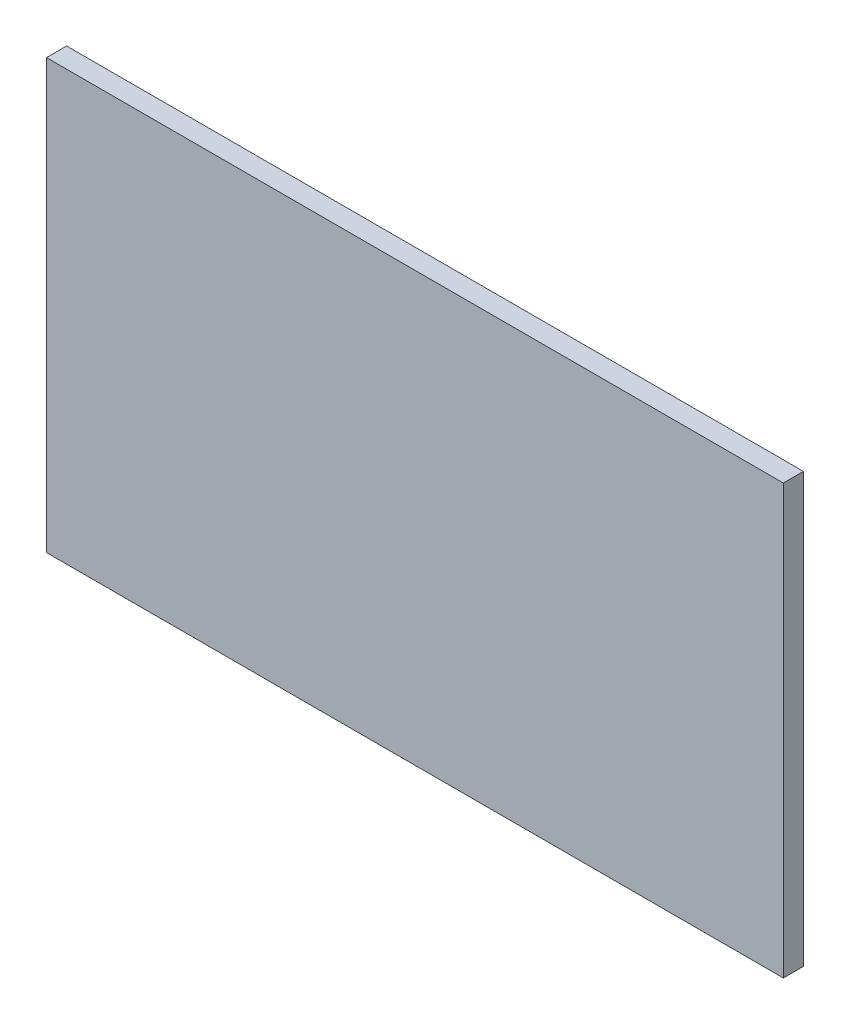
ISO-10303-21;
HEADER;
FILE_DESCRIPTION(('STEP AP214'),'2;1');
FILE_NAME('part.step','',(''),(''),'','','');
FILE_SCHEMA(('AUTOMOTIVE_DESIGN { 1 0 10303 214 1 1 1 1 }'));
ENDSEC;
DATA;
#1=APPLICATION_CONTEXT('core data for automotive mechanical design processes');
#2=APPLICATION_PROTOCOL_DEFINITION('international standard','automotive_design',2000,#1);
#3=PRODUCT_CONTEXT('',#1,'mechanical');
#4=PRODUCT('Part','Part','',(#3));
#5=PRODUCT_RELATED_PRODUCT_CATEGORY('part','',(#4));
#6=PRODUCT_DEFINITION_FORMATION('','',#4);
#7=PRODUCT_DEFINITION_CONTEXT('part definition',#1,'design');
#8=PRODUCT_DEFINITION('design','',#6,#7);
#9=PRODUCT_DEFINITION_SHAPE('','',#8);
#10=(LENGTH_UNIT() NAMED_UNIT(*) SI_UNIT(.MILLI.,.METRE.));
#11=(NAMED_UNIT(*) PLANE_ANGLE_UNIT() SI_UNIT($,.RADIAN.));
#12=(NAMED_UNIT(*) SI_UNIT($,.STERADIAN.) SOLID_ANGLE_UNIT());
#13=UNCERTAINTY_MEASURE_WITH_UNIT(LENGTH_MEASURE(1.E-05),#10,'distance_accuracy_value','');
#14=(GEOMETRIC_REPRESENTATION_CONTEXT(3) GLOBAL_UNCERTAINTY_ASSIGNED_CONTEXT((#13)) GLOBAL_UNIT_ASSIGNED_CONTEXT((#10,
#11,#12)) REPRESENTATION_CONTEXT('',''));
#15=CARTESIAN_POINT('',(0.,0.,0.));
#16=DIRECTION('',(0.,0.,1.));
#17=DIRECTION('',(1.,0.,0.));
#18=AXIS2_PLACEMENT_3D('',#15,#16,#17);
#19=CARTESIAN_POINT('',(0.,-64.,3.));
#20=DIRECTION('',(1.,0.,0.));
#21=DIRECTION('',(0.,0.,-1.));
#22=AXIS2_PLACEMENT_3D('',#19,#20,#21);
#23=PLANE('',#22);
#24=DIRECTION('',(0.,-1.,0.));
#25=VECTOR('',#24,1.);
#26=CARTESIAN_POINT('',(0.,-64.,0.));
#27=LINE('',#26,#25);
#28=CARTESIAN_POINT('',(0.,0.,0.));
#29=VERTEX_POINT('',#28);
#30=CARTESIAN_POINT('',(0.,-64.,0.));
#31=VERTEX_POINT('',#30);
#32=EDGE_CURVE('E107',#29,#31,#27,.T.);
#33=ORIENTED_EDGE('',*,*,#32,.T.);
#34=DIRECTION('',(0.,0.,-1.));
#35=VECTOR('',#34,1.);
#36=CARTESIAN_POINT('',(0.,-64.,3.));
#37=LINE('',#36,#35);
#38=CARTESIAN_POINT('',(0.,-64.,3.));
#39=VERTEX_POINT('',#38);
#40=EDGE_CURVE('E11',#39,#31,#37,.T.);
#41=ORIENTED_EDGE('',*,*,#40,.F.);
#42=DIRECTION('',(0.,-1.,0.));
#43=VECTOR('',#42,1.);
#44=CARTESIAN_POINT('',(0.,-64.,3.));
#45=LINE('',#44,#43);
#46=CARTESIAN_POINT('',(0.,0.,3.));
#47=VERTEX_POINT('',#46);
#48=EDGE_CURVE('E91',#47,#39,#45,.T.);
#49=ORIENTED_EDGE('',*,*,#48,.F.);
#50=DIRECTION('',(0.,0.,-1.));
#51=VECTOR('',#50,1.);
#52=CARTESIAN_POINT('',(0.,0.,3.));
#53=LINE('',#52,#51);
#54=EDGE_CURVE('E103',#47,#29,#53,.T.);
#55=ORIENTED_EDGE('',*,*,#54,.T.);
#56=EDGE_LOOP('',(#33,#41,#49,#55));
#57=FACE_BOUND('',#56,.T.);
#58=ADVANCED_FACE('F39',(#57),#23,.F.);
#59=CARTESIAN_POINT('',(110.,-64.,3.));
#60=DIRECTION('',(0.,1.,0.));
#61=DIRECTION('',(-1.,0.,0.));
#62=AXIS2_PLACEMENT_3D('',#59,#60,#61);
#63=PLANE('',#62);
#64=DIRECTION('',(1.,0.,0.));
#65=VECTOR('',#64,1.);
#66=CARTESIAN_POINT('',(110.,-64.,0.));
#67=LINE('',#66,#65);
#68=CARTESIAN_POINT('',(110.,-64.,0.));
#69=VERTEX_POINT('',#68);
#70=EDGE_CURVE('E96',#31,#69,#67,.T.);
#71=ORIENTED_EDGE('',*,*,#70,.T.);
#72=DIRECTION('',(0.,0.,-1.));
#73=VECTOR('',#72,1.);
#74=CARTESIAN_POINT('',(110.,-64.,3.));
#75=LINE('',#74,#73);
#76=CARTESIAN_POINT('',(110.,-64.,3.));
#77=VERTEX_POINT('',#76);
#78=EDGE_CURVE('E48',#77,#69,#75,.T.);
#79=ORIENTED_EDGE('',*,*,#78,.F.);
#80=DIRECTION('',(1.,0.,0.));
#81=VECTOR('',#80,1.);
#82=CARTESIAN_POINT('',(110.,-64.,3.));
#83=LINE('',#82,#81);
#84=EDGE_CURVE('E86',#39,#77,#83,.T.);
#85=ORIENTED_EDGE('',*,*,#84,.F.);
#86=ORIENTED_EDGE('',*,*,#40,.T.);
#87=EDGE_LOOP('',(#71,#79,#85,#86));
#88=FACE_BOUND('',#87,.T.);
#89=ADVANCED_FACE('F95',(#88),#63,.F.);
#90=CARTESIAN_POINT('',(110.,0.,3.));
#91=DIRECTION('',(-1.,0.,0.));
#92=DIRECTION('',(0.,-1.,0.));
#93=AXIS2_PLACEMENT_3D('',#90,#91,#92);
#94=PLANE('',#93);
#95=DIRECTION('',(0.,1.,0.));
#96=VECTOR('',#95,1.);
#97=CARTESIAN_POINT('',(110.,0.,0.));
#98=LINE('',#97,#96);
#99=CARTESIAN_POINT('',(110.,0.,0.));
#100=VERTEX_POINT('',#99);
#101=EDGE_CURVE('E73',#69,#100,#98,.T.);
#102=ORIENTED_EDGE('',*,*,#101,.T.);
#103=DIRECTION('',(0.,0.,-1.));
#104=VECTOR('',#103,1.);
#105=CARTESIAN_POINT('',(110.,0.,3.));
#106=LINE('',#105,#104);
#107=CARTESIAN_POINT('',(110.,0.,3.));
#108=VERTEX_POINT('',#107);
#109=EDGE_CURVE('E98',#108,#100,#106,.T.);
#110=ORIENTED_EDGE('',*,*,#109,.F.);
#111=DIRECTION('',(0.,1.,0.));
#112=VECTOR('',#111,1.);
#113=CARTESIAN_POINT('',(110.,0.,3.));
#114=LINE('',#113,#112);
#115=EDGE_CURVE('E89',#77,#108,#114,.T.);
#116=ORIENTED_EDGE('',*,*,#115,.F.);
#117=ORIENTED_EDGE('',*,*,#78,.T.);
#118=EDGE_LOOP('',(#102,#110,#116,#117));
#119=FACE_BOUND('',#118,.T.);
#120=ADVANCED_FACE('F99',(#119),#94,.F.);
#121=CARTESIAN_POINT('',(0.,0.,3.));
#122=DIRECTION('',(0.,-1.,0.));
#123=DIRECTION('',(0.,0.,-1.));
#124=AXIS2_PLACEMENT_3D('',#121,#122,#123);
#125=PLANE('',#124);
#126=DIRECTION('',(-1.,0.,0.));
#127=VECTOR('',#126,1.);
#128=CARTESIAN_POINT('',(0.,0.,0.));
#129=LINE('',#128,#127);
#130=EDGE_CURVE('E79',#100,#29,#129,.T.);
#131=ORIENTED_EDGE('',*,*,#130,.T.);
#132=ORIENTED_EDGE('',*,*,#54,.F.);
#133=DIRECTION('',(-1.,0.,0.));
#134=VECTOR('',#133,1.);
#135=CARTESIAN_POINT('',(0.,0.,3.));
#136=LINE('',#135,#134);
#137=EDGE_CURVE('E56',#108,#47,#136,.T.);
#138=ORIENTED_EDGE('',*,*,#137,.F.);
#139=ORIENTED_EDGE('',*,*,#109,.T.);
#140=EDGE_LOOP('',(#131,#132,#138,#139));
#141=FACE_BOUND('',#140,.T.);
#142=ADVANCED_FACE('F120',(#141),#125,.F.);
#143=CARTESIAN_POINT('',(0.,0.,3.));
#144=DIRECTION('',(0.,0.,-1.));
#145=DIRECTION('',(-1.,0.,0.));
#146=AXIS2_PLACEMENT_3D('',#143,#144,#145);
#147=PLANE('',#146);
#148=ORIENTED_EDGE('',*,*,#48,.T.);
#149=ORIENTED_EDGE('',*,*,#84,.T.);
#150=ORIENTED_EDGE('',*,*,#115,.T.);
#151=ORIENTED_EDGE('',*,*,#137,.T.);
#152=EDGE_LOOP('',(#148,#149,#150,#151));
#153=FACE_BOUND('',#152,.T.);
#154=ADVANCED_FACE('F87',(#153),#147,.F.);
#155=CARTESIAN_POINT('',(0.,0.,0.));
#156=DIRECTION('',(0.,0.,-1.));
#157=DIRECTION('',(-1.,0.,0.));
#158=AXIS2_PLACEMENT_3D('',#155,#156,#157);
#159=PLANE('',#158);
#160=ORIENTED_EDGE('',*,*,#32,.F.);
#161=ORIENTED_EDGE('',*,*,#130,.F.);
#162=ORIENTED_EDGE('',*,*,#101,.F.);
#163=ORIENTED_EDGE('',*,*,#70,.F.);
#164=EDGE_LOOP('',(#160,#161,#162,#163));
#165=FACE_BOUND('',#164,.T.);
#166=ADVANCED_FACE('F123',(#165),#159,.T.);
#167=CLOSED_SHELL('',(#58,#89,#120,#142,#154,#166));
#168=MANIFOLD_SOLID_BREP('B2',#167);
#169=ADVANCED_BREP_SHAPE_REPRESENTATION('',(#18,#168),#14);
#170=SHAPE_DEFINITION_REPRESENTATION(#9,#169);
ENDSEC;
END-ISO-10303-21;
